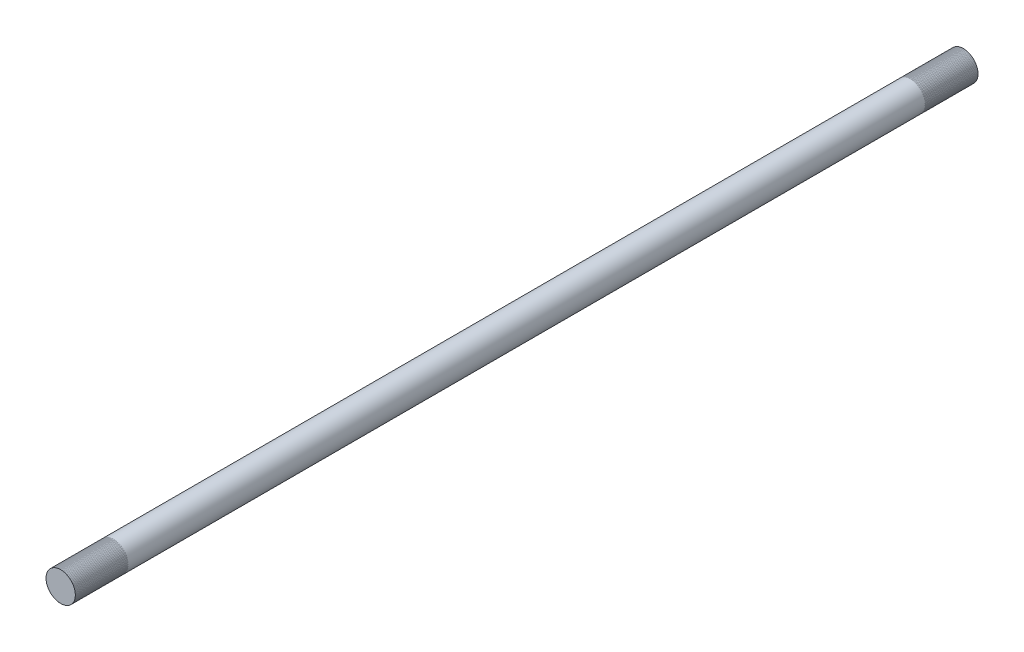
ISO-10303-21;
HEADER;
FILE_DESCRIPTION(('STEP AP214'),'2;1');
FILE_NAME('part.step','',(''),(''),'','','');
FILE_SCHEMA(('AUTOMOTIVE_DESIGN { 1 0 10303 214 1 1 1 1 }'));
ENDSEC;
DATA;
#1=APPLICATION_CONTEXT('core data for automotive mechanical design processes');
#2=APPLICATION_PROTOCOL_DEFINITION('international standard','automotive_design',2000,#1);
#3=PRODUCT_CONTEXT('',#1,'mechanical');
#4=PRODUCT('Part','Part','',(#3));
#5=PRODUCT_RELATED_PRODUCT_CATEGORY('part','',(#4));
#6=PRODUCT_DEFINITION_FORMATION('','',#4);
#7=PRODUCT_DEFINITION_CONTEXT('part definition',#1,'design');
#8=PRODUCT_DEFINITION('design','',#6,#7);
#9=PRODUCT_DEFINITION_SHAPE('','',#8);
#10=(LENGTH_UNIT() NAMED_UNIT(*) SI_UNIT(.MILLI.,.METRE.));
#11=(NAMED_UNIT(*) PLANE_ANGLE_UNIT() SI_UNIT($,.RADIAN.));
#12=(NAMED_UNIT(*) SI_UNIT($,.STERADIAN.) SOLID_ANGLE_UNIT());
#13=UNCERTAINTY_MEASURE_WITH_UNIT(LENGTH_MEASURE(1.E-05),#10,'distance_accuracy_value','');
#14=(GEOMETRIC_REPRESENTATION_CONTEXT(3) GLOBAL_UNCERTAINTY_ASSIGNED_CONTEXT((#13)) GLOBAL_UNIT_ASSIGNED_CONTEXT((#10,
#11,#12)) REPRESENTATION_CONTEXT('',''));
#15=CARTESIAN_POINT('',(0.,0.,0.));
#16=DIRECTION('',(0.,0.,1.));
#17=DIRECTION('',(1.,0.,0.));
#18=AXIS2_PLACEMENT_3D('',#15,#16,#17);
#19=CARTESIAN_POINT('',(0.,0.,-22.86));
#20=DIRECTION('',(0.,0.,1.));
#21=DIRECTION('',(1.,0.,0.));
#22=AXIS2_PLACEMENT_3D('',#19,#20,#21);
#23=PLANE('',#22);
#24=CARTESIAN_POINT('',(0.,0.,-22.86));
#25=DIRECTION('',(0.,0.,1.));
#26=DIRECTION('',(1.,0.,0.));
#27=AXIS2_PLACEMENT_3D('',#24,#25,#26);
#28=CIRCLE('',#27,6.34999999999995);
#29=CARTESIAN_POINT('',(6.35,0.,-22.86));
#30=VERTEX_POINT('',#29);
#31=EDGE_CURVE('E51',#30,#30,#28,.T.);
#32=ORIENTED_EDGE('',*,*,#31,.F.);
#33=EDGE_LOOP('',(#32));
#34=FACE_BOUND('',#33,.T.);
#35=ADVANCED_FACE('F44',(#34),#23,.F.);
#36=CARTESIAN_POINT('',(0.,0.,385.673772242415));
#37=DIRECTION('',(0.,0.,-1.));
#38=DIRECTION('',(-1.,0.,0.));
#39=AXIS2_PLACEMENT_3D('',#36,#37,#38);
#40=CYLINDRICAL_SURFACE('',#39,6.34999999999995);
#41=CARTESIAN_POINT('',(0.,0.,367.713260000277));
#42=DIRECTION('',(0.,0.,-1.));
#43=DIRECTION('',(-1.,0.,0.));
#44=AXIS2_PLACEMENT_3D('',#41,#42,#43);
#45=CIRCLE('',#44,6.34999999999995);
#46=CARTESIAN_POINT('',(-6.34999999999989,0.,367.713260000277));
#47=VERTEX_POINT('',#46);
#48=EDGE_CURVE('E11',#47,#47,#45,.T.);
#49=ORIENTED_EDGE('',*,*,#48,.T.);
#50=EDGE_LOOP('',(#49));
#51=FACE_BOUND('',#50,.T.);
#52=ORIENTED_EDGE('',*,*,#31,.T.);
#53=EDGE_LOOP('',(#52));
#54=FACE_BOUND('',#53,.T.);
#55=ADVANCED_FACE('F46',(#51,#54),#40,.T.);
#56=CARTESIAN_POINT('',(0.,0.,367.713260000277));
#57=DIRECTION('',(0.,0.,-1.));
#58=DIRECTION('',(-1.,0.,0.));
#59=AXIS2_PLACEMENT_3D('',#56,#57,#58);
#60=PLANE('',#59);
#61=ORIENTED_EDGE('',*,*,#48,.F.);
#62=EDGE_LOOP('',(#61));
#63=FACE_BOUND('',#62,.T.);
#64=ADVANCED_FACE('F62',(#63),#60,.F.);
#65=CLOSED_SHELL('',(#35,#55,#64));
#66=MANIFOLD_SOLID_BREP('B2',#65);
#67=CARTESIAN_POINT('',(3.26683124995952E-11,-1.65631397486266E-11,356.283260000277));
#68=DIRECTION('',(0.,0.,1.));
#69=DIRECTION('',(-0.469199705637428,-0.883092088193384,0.));
#70=AXIS2_PLACEMENT_3D('',#67,#68,#69);
#71=CYLINDRICAL_SURFACE('',#70,6.35);
#72=CARTESIAN_POINT('',(3.26717819465472E-11,-1.65631397486266E-11,344.853260000277));
#73=DIRECTION('',(0.,0.,1.));
#74=DIRECTION('',(-0.469199705637428,-0.883092088193384,0.));
#75=AXIS2_PLACEMENT_3D('',#72,#73,#74);
#76=CIRCLE('',#75,6.35);
#77=CARTESIAN_POINT('',(-2.97941813076499,-5.60763476004455,344.853260000277));
#78=VERTEX_POINT('',#77);
#79=EDGE_CURVE('E96',#78,#78,#76,.T.);
#80=ORIENTED_EDGE('',*,*,#79,.F.);
#81=EDGE_LOOP('',(#80));
#82=FACE_BOUND('',#81,.T.);
#83=CARTESIAN_POINT('',(3.26648430526433E-11,-1.65700786425305E-11,367.713260000277));
#84=DIRECTION('',(0.,0.,1.));
#85=DIRECTION('',(-0.469199705637428,-0.883092088193384,0.));
#86=AXIS2_PLACEMENT_3D('',#83,#84,#85);
#87=CIRCLE('',#86,6.35);
#88=CARTESIAN_POINT('',(-2.979418130765,-5.60763476004456,367.713260000277));
#89=VERTEX_POINT('',#88);
#90=EDGE_CURVE('E43',#89,#89,#87,.F.);
#91=ORIENTED_EDGE('',*,*,#90,.F.);
#92=EDGE_LOOP('',(#91));
#93=FACE_BOUND('',#92,.T.);
#94=ADVANCED_FACE('F92',(#82,#93),#71,.F.);
#95=OPEN_SHELL('',(#94));
#96=SHELL_BASED_SURFACE_MODEL('B6',(#95));
#97=CARTESIAN_POINT('',(0.,0.,-11.43));
#98=DIRECTION('',(0.,0.,-1.));
#99=DIRECTION('',(-1.,0.,0.));
#100=AXIS2_PLACEMENT_3D('',#97,#98,#99);
#101=CYLINDRICAL_SURFACE('',#100,6.35);
#102=CARTESIAN_POINT('',(0.,0.,-22.86));
#103=DIRECTION('',(0.,0.,-1.));
#104=DIRECTION('',(-1.,0.,0.));
#105=AXIS2_PLACEMENT_3D('',#102,#103,#104);
#106=CIRCLE('',#105,6.35);
#107=CARTESIAN_POINT('',(-6.34999999999995,0.,-22.86));
#108=VERTEX_POINT('',#107);
#109=EDGE_CURVE('E133',#108,#108,#106,.F.);
#110=ORIENTED_EDGE('',*,*,#109,.F.);
#111=EDGE_LOOP('',(#110));
#112=FACE_BOUND('',#111,.T.);
#113=CARTESIAN_POINT('',(0.,0.,0.));
#114=DIRECTION('',(0.,0.,-1.));
#115=DIRECTION('',(-1.,0.,0.));
#116=AXIS2_PLACEMENT_3D('',#113,#114,#115);
#117=CIRCLE('',#116,6.35);
#118=CARTESIAN_POINT('',(-6.34999999999996,0.,0.));
#119=VERTEX_POINT('',#118);
#120=EDGE_CURVE('E91',#119,#119,#117,.T.);
#121=ORIENTED_EDGE('',*,*,#120,.F.);
#122=EDGE_LOOP('',(#121));
#123=FACE_BOUND('',#122,.T.);
#124=ADVANCED_FACE('F129',(#112,#123),#101,.F.);
#125=OPEN_SHELL('',(#124));
#126=SHELL_BASED_SURFACE_MODEL('B38',(#125));
#127=ADVANCED_BREP_SHAPE_REPRESENTATION('',(#18,#66),#14);
#128=MANIFOLD_SURFACE_SHAPE_REPRESENTATION('',(#18,#96,#126),#14);
#129=SHAPE_REPRESENTATION('',(#18),#14);
#130=SHAPE_DEFINITION_REPRESENTATION(#9,#129);
#131=SHAPE_REPRESENTATION_RELATIONSHIP('','',#129,#127);
#132=SHAPE_REPRESENTATION_RELATIONSHIP('','',#129,#128);
ENDSEC;
END-ISO-10303-21;
